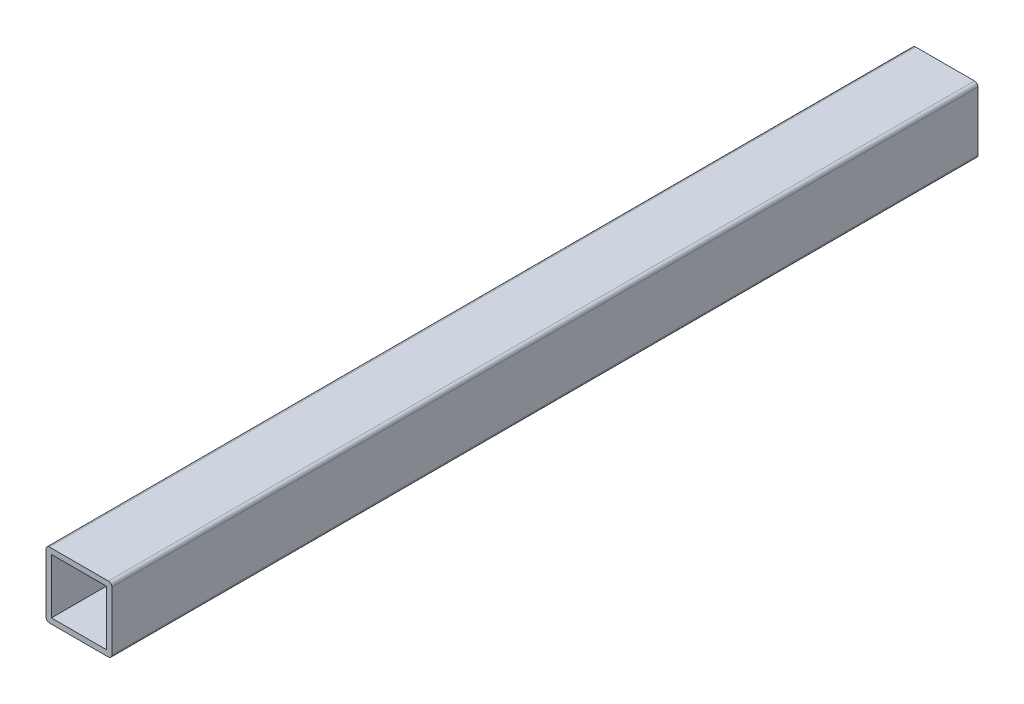
ISO-10303-21;
HEADER;
FILE_DESCRIPTION(('STEP AP214'),'2;1');
FILE_NAME('part.step','',(''),(''),'','','');
FILE_SCHEMA(('AUTOMOTIVE_DESIGN { 1 0 10303 214 1 1 1 1 }'));
ENDSEC;
DATA;
#1=APPLICATION_CONTEXT('core data for automotive mechanical design processes');
#2=APPLICATION_PROTOCOL_DEFINITION('international standard','automotive_design',2000,#1);
#3=PRODUCT_CONTEXT('',#1,'mechanical');
#4=PRODUCT('Part','Part','',(#3));
#5=PRODUCT_RELATED_PRODUCT_CATEGORY('part','',(#4));
#6=PRODUCT_DEFINITION_FORMATION('','',#4);
#7=PRODUCT_DEFINITION_CONTEXT('part definition',#1,'design');
#8=PRODUCT_DEFINITION('design','',#6,#7);
#9=PRODUCT_DEFINITION_SHAPE('','',#8);
#10=(LENGTH_UNIT() NAMED_UNIT(*) SI_UNIT(.MILLI.,.METRE.));
#11=(NAMED_UNIT(*) PLANE_ANGLE_UNIT() SI_UNIT($,.RADIAN.));
#12=(NAMED_UNIT(*) SI_UNIT($,.STERADIAN.) SOLID_ANGLE_UNIT());
#13=UNCERTAINTY_MEASURE_WITH_UNIT(LENGTH_MEASURE(1.E-05),#10,'distance_accuracy_value','');
#14=(GEOMETRIC_REPRESENTATION_CONTEXT(3) GLOBAL_UNCERTAINTY_ASSIGNED_CONTEXT((#13)) GLOBAL_UNIT_ASSIGNED_CONTEXT((#10,
#11,#12)) REPRESENTATION_CONTEXT('',''));
#15=CARTESIAN_POINT('',(0.,0.,0.));
#16=DIRECTION('',(0.,0.,1.));
#17=DIRECTION('',(1.,0.,0.));
#18=AXIS2_PLACEMENT_3D('',#15,#16,#17);
#19=CARTESIAN_POINT('',(0.,0.,0.));
#20=DIRECTION('',(0.,0.,1.));
#21=DIRECTION('',(1.,0.,0.));
#22=AXIS2_PLACEMENT_3D('',#19,#20,#21);
#23=PLANE('',#22);
#24=DIRECTION('',(1.,0.,0.));
#25=VECTOR('',#24,1.);
#26=CARTESIAN_POINT('',(0.,-19.,0.));
#27=LINE('',#26,#25);
#28=CARTESIAN_POINT('',(1.,-19.,0.));
#29=VERTEX_POINT('',#28);
#30=CARTESIAN_POINT('',(18.,-19.,0.));
#31=VERTEX_POINT('',#30);
#32=EDGE_CURVE('E169',#29,#31,#27,.T.);
#33=ORIENTED_EDGE('',*,*,#32,.F.);
#34=CARTESIAN_POINT('',(1.,-18.,0.));
#35=DIRECTION('',(0.,0.,1.));
#36=DIRECTION('',(1.,0.,0.));
#37=AXIS2_PLACEMENT_3D('',#34,#35,#36);
#38=CIRCLE('',#37,1.);
#39=CARTESIAN_POINT('',(0.,-18.,0.));
#40=VERTEX_POINT('',#39);
#41=EDGE_CURVE('E153',#29,#40,#38,.F.);
#42=ORIENTED_EDGE('',*,*,#41,.T.);
#43=DIRECTION('',(0.,-1.,0.));
#44=VECTOR('',#43,1.);
#45=CARTESIAN_POINT('',(0.,0.,0.));
#46=LINE('',#45,#44);
#47=CARTESIAN_POINT('',(0.,-1.,0.));
#48=VERTEX_POINT('',#47);
#49=EDGE_CURVE('E172',#48,#40,#46,.T.);
#50=ORIENTED_EDGE('',*,*,#49,.F.);
#51=CARTESIAN_POINT('',(1.,-1.,0.));
#52=DIRECTION('',(0.,0.,1.));
#53=DIRECTION('',(1.,0.,0.));
#54=AXIS2_PLACEMENT_3D('',#51,#52,#53);
#55=CIRCLE('',#54,1.);
#56=CARTESIAN_POINT('',(1.,0.,0.));
#57=VERTEX_POINT('',#56);
#58=EDGE_CURVE('E155',#48,#57,#55,.F.);
#59=ORIENTED_EDGE('',*,*,#58,.T.);
#60=DIRECTION('',(-1.,0.,0.));
#61=VECTOR('',#60,1.);
#62=CARTESIAN_POINT('',(0.,0.,0.));
#63=LINE('',#62,#61);
#64=CARTESIAN_POINT('',(18.,0.,0.));
#65=VERTEX_POINT('',#64);
#66=EDGE_CURVE('E164',#65,#57,#63,.T.);
#67=ORIENTED_EDGE('',*,*,#66,.F.);
#68=CARTESIAN_POINT('',(18.,-1.,0.));
#69=DIRECTION('',(0.,0.,1.));
#70=DIRECTION('',(1.,0.,0.));
#71=AXIS2_PLACEMENT_3D('',#68,#69,#70);
#72=CIRCLE('',#71,1.);
#73=CARTESIAN_POINT('',(19.,-1.,0.));
#74=VERTEX_POINT('',#73);
#75=EDGE_CURVE('E158',#65,#74,#72,.F.);
#76=ORIENTED_EDGE('',*,*,#75,.T.);
#77=DIRECTION('',(0.,1.,0.));
#78=VECTOR('',#77,1.);
#79=CARTESIAN_POINT('',(19.,0.,0.));
#80=LINE('',#79,#78);
#81=CARTESIAN_POINT('',(19.,-18.,0.));
#82=VERTEX_POINT('',#81);
#83=EDGE_CURVE('E167',#82,#74,#80,.T.);
#84=ORIENTED_EDGE('',*,*,#83,.F.);
#85=CARTESIAN_POINT('',(18.,-18.,0.));
#86=DIRECTION('',(0.,0.,1.));
#87=DIRECTION('',(1.,0.,0.));
#88=AXIS2_PLACEMENT_3D('',#85,#86,#87);
#89=CIRCLE('',#88,1.);
#90=EDGE_CURVE('E139',#82,#31,#89,.F.);
#91=ORIENTED_EDGE('',*,*,#90,.T.);
#92=EDGE_LOOP('',(#33,#42,#50,#59,#67,#76,#84,#91));
#93=FACE_BOUND('',#92,.T.);
#94=DIRECTION('',(0.,-1.,0.));
#95=VECTOR('',#94,1.);
#96=CARTESIAN_POINT('',(1.56,-1.56,0.));
#97=LINE('',#96,#95);
#98=CARTESIAN_POINT('',(1.56,-1.56,0.));
#99=VERTEX_POINT('',#98);
#100=CARTESIAN_POINT('',(1.56,-17.44,0.));
#101=VERTEX_POINT('',#100);
#102=EDGE_CURVE('E192',#99,#101,#97,.T.);
#103=ORIENTED_EDGE('',*,*,#102,.T.);
#104=DIRECTION('',(1.,0.,0.));
#105=VECTOR('',#104,1.);
#106=CARTESIAN_POINT('',(1.56,-17.44,0.));
#107=LINE('',#106,#105);
#108=CARTESIAN_POINT('',(17.44,-17.44,0.));
#109=VERTEX_POINT('',#108);
#110=EDGE_CURVE('E189',#101,#109,#107,.T.);
#111=ORIENTED_EDGE('',*,*,#110,.T.);
#112=DIRECTION('',(0.,1.,0.));
#113=VECTOR('',#112,1.);
#114=CARTESIAN_POINT('',(17.44,-1.56,0.));
#115=LINE('',#114,#113);
#116=CARTESIAN_POINT('',(17.44,-1.56,0.));
#117=VERTEX_POINT('',#116);
#118=EDGE_CURVE('E186',#109,#117,#115,.T.);
#119=ORIENTED_EDGE('',*,*,#118,.T.);
#120=DIRECTION('',(-1.,0.,0.));
#121=VECTOR('',#120,1.);
#122=CARTESIAN_POINT('',(1.56,-1.56,0.));
#123=LINE('',#122,#121);
#124=EDGE_CURVE('E183',#117,#99,#123,.T.);
#125=ORIENTED_EDGE('',*,*,#124,.T.);
#126=EDGE_LOOP('',(#103,#111,#119,#125));
#127=FACE_BOUND('',#126,.T.);
#128=ADVANCED_FACE('F33',(#93,#127),#23,.F.);
#129=CARTESIAN_POINT('',(0.,0.,900.));
#130=DIRECTION('',(1.,0.,0.));
#131=DIRECTION('',(0.,1.,0.));
#132=AXIS2_PLACEMENT_3D('',#129,#130,#131);
#133=PLANE('',#132);
#134=DIRECTION('',(0.,0.,-1.));
#135=VECTOR('',#134,1.);
#136=CARTESIAN_POINT('',(0.,-18.,900.));
#137=LINE('',#136,#135);
#138=CARTESIAN_POINT('',(0.,-18.,250.));
#139=VERTEX_POINT('',#138);
#140=EDGE_CURVE('E148',#40,#139,#137,.F.);
#141=ORIENTED_EDGE('',*,*,#140,.T.);
#142=DIRECTION('',(0.,1.,0.));
#143=VECTOR('',#142,1.);
#144=CARTESIAN_POINT('',(0.,0.,250.));
#145=LINE('',#144,#143);
#146=CARTESIAN_POINT('',(0.,-1.,250.));
#147=VERTEX_POINT('',#146);
#148=EDGE_CURVE('E204',#139,#147,#145,.T.);
#149=ORIENTED_EDGE('',*,*,#148,.T.);
#150=DIRECTION('',(0.,0.,-1.));
#151=VECTOR('',#150,1.);
#152=CARTESIAN_POINT('',(0.,-1.,900.));
#153=LINE('',#152,#151);
#154=EDGE_CURVE('E151',#147,#48,#153,.T.);
#155=ORIENTED_EDGE('',*,*,#154,.T.);
#156=ORIENTED_EDGE('',*,*,#49,.T.);
#157=EDGE_LOOP('',(#141,#149,#155,#156));
#158=FACE_BOUND('',#157,.T.);
#159=ADVANCED_FACE('F228',(#158),#133,.F.);
#160=CARTESIAN_POINT('',(0.,-19.,900.));
#161=DIRECTION('',(0.,1.,0.));
#162=DIRECTION('',(0.,0.,1.));
#163=AXIS2_PLACEMENT_3D('',#160,#161,#162);
#164=PLANE('',#163);
#165=DIRECTION('',(0.,0.,-1.));
#166=VECTOR('',#165,1.);
#167=CARTESIAN_POINT('',(18.,-19.,900.));
#168=LINE('',#167,#166);
#169=CARTESIAN_POINT('',(18.,-19.,250.));
#170=VERTEX_POINT('',#169);
#171=EDGE_CURVE('E162',#31,#170,#168,.F.);
#172=ORIENTED_EDGE('',*,*,#171,.T.);
#173=DIRECTION('',(1.,0.,0.));
#174=VECTOR('',#173,1.);
#175=CARTESIAN_POINT('',(-32.,-19.,250.));
#176=LINE('',#175,#174);
#177=CARTESIAN_POINT('',(1.,-19.,250.));
#178=VERTEX_POINT('',#177);
#179=EDGE_CURVE('E122',#178,#170,#176,.T.);
#180=ORIENTED_EDGE('',*,*,#179,.F.);
#181=DIRECTION('',(0.,0.,-1.));
#182=VECTOR('',#181,1.);
#183=CARTESIAN_POINT('',(1.,-19.,900.));
#184=LINE('',#183,#182);
#185=EDGE_CURVE('E160',#178,#29,#184,.T.);
#186=ORIENTED_EDGE('',*,*,#185,.T.);
#187=ORIENTED_EDGE('',*,*,#32,.T.);
#188=EDGE_LOOP('',(#172,#180,#186,#187));
#189=FACE_BOUND('',#188,.T.);
#190=ADVANCED_FACE('F235',(#189),#164,.F.);
#191=CARTESIAN_POINT('',(19.,0.,900.));
#192=DIRECTION('',(-1.,0.,0.));
#193=DIRECTION('',(0.,0.,1.));
#194=AXIS2_PLACEMENT_3D('',#191,#192,#193);
#195=PLANE('',#194);
#196=DIRECTION('',(0.,0.,-1.));
#197=VECTOR('',#196,1.);
#198=CARTESIAN_POINT('',(19.,-1.,900.));
#199=LINE('',#198,#197);
#200=CARTESIAN_POINT('',(19.,-1.,250.));
#201=VERTEX_POINT('',#200);
#202=EDGE_CURVE('E136',#74,#201,#199,.F.);
#203=ORIENTED_EDGE('',*,*,#202,.T.);
#204=DIRECTION('',(0.,1.,0.));
#205=VECTOR('',#204,1.);
#206=CARTESIAN_POINT('',(19.,-19.,250.));
#207=LINE('',#206,#205);
#208=CARTESIAN_POINT('',(19.,-18.,250.));
#209=VERTEX_POINT('',#208);
#210=EDGE_CURVE('E55',#209,#201,#207,.T.);
#211=ORIENTED_EDGE('',*,*,#210,.F.);
#212=DIRECTION('',(0.,0.,-1.));
#213=VECTOR('',#212,1.);
#214=CARTESIAN_POINT('',(19.,-18.,900.));
#215=LINE('',#214,#213);
#216=EDGE_CURVE('E41',#209,#82,#215,.T.);
#217=ORIENTED_EDGE('',*,*,#216,.T.);
#218=ORIENTED_EDGE('',*,*,#83,.T.);
#219=EDGE_LOOP('',(#203,#211,#217,#218));
#220=FACE_BOUND('',#219,.T.);
#221=ADVANCED_FACE('F132',(#220),#195,.F.);
#222=CARTESIAN_POINT('',(0.,0.,900.));
#223=DIRECTION('',(0.,-1.,0.));
#224=DIRECTION('',(0.,0.,-1.));
#225=AXIS2_PLACEMENT_3D('',#222,#223,#224);
#226=PLANE('',#225);
#227=DIRECTION('',(0.,0.,-1.));
#228=VECTOR('',#227,1.);
#229=CARTESIAN_POINT('',(1.,0.,900.));
#230=LINE('',#229,#228);
#231=CARTESIAN_POINT('',(1.,0.,250.));
#232=VERTEX_POINT('',#231);
#233=EDGE_CURVE('E141',#57,#232,#230,.F.);
#234=ORIENTED_EDGE('',*,*,#233,.T.);
#235=DIRECTION('',(1.,0.,0.));
#236=VECTOR('',#235,1.);
#237=CARTESIAN_POINT('',(-32.,0.,250.));
#238=LINE('',#237,#236);
#239=CARTESIAN_POINT('',(18.,0.,250.));
#240=VERTEX_POINT('',#239);
#241=EDGE_CURVE('E128',#232,#240,#238,.T.);
#242=ORIENTED_EDGE('',*,*,#241,.T.);
#243=DIRECTION('',(0.,0.,-1.));
#244=VECTOR('',#243,1.);
#245=CARTESIAN_POINT('',(18.,0.,900.));
#246=LINE('',#245,#244);
#247=EDGE_CURVE('E146',#240,#65,#246,.T.);
#248=ORIENTED_EDGE('',*,*,#247,.T.);
#249=ORIENTED_EDGE('',*,*,#66,.T.);
#250=EDGE_LOOP('',(#234,#242,#248,#249));
#251=FACE_BOUND('',#250,.T.);
#252=ADVANCED_FACE('F212',(#251),#226,.F.);
#253=CARTESIAN_POINT('',(1.56,-1.56,900.));
#254=DIRECTION('',(1.,0.,0.));
#255=DIRECTION('',(0.,1.,0.));
#256=AXIS2_PLACEMENT_3D('',#253,#254,#255);
#257=PLANE('',#256);
#258=DIRECTION('',(0.,1.,0.));
#259=VECTOR('',#258,1.);
#260=CARTESIAN_POINT('',(1.56,-1.56,250.));
#261=LINE('',#260,#259);
#262=CARTESIAN_POINT('',(1.56,-17.44,250.));
#263=VERTEX_POINT('',#262);
#264=CARTESIAN_POINT('',(1.56,-1.56,250.));
#265=VERTEX_POINT('',#264);
#266=EDGE_CURVE('E48',#263,#265,#261,.T.);
#267=ORIENTED_EDGE('',*,*,#266,.F.);
#268=DIRECTION('',(0.,0.,-1.));
#269=VECTOR('',#268,1.);
#270=CARTESIAN_POINT('',(1.56,-17.44,900.));
#271=LINE('',#270,#269);
#272=EDGE_CURVE('E175',#263,#101,#271,.T.);
#273=ORIENTED_EDGE('',*,*,#272,.T.);
#274=ORIENTED_EDGE('',*,*,#102,.F.);
#275=DIRECTION('',(0.,0.,-1.));
#276=VECTOR('',#275,1.);
#277=CARTESIAN_POINT('',(1.56,-1.56,900.));
#278=LINE('',#277,#276);
#279=EDGE_CURVE('E181',#265,#99,#278,.T.);
#280=ORIENTED_EDGE('',*,*,#279,.F.);
#281=EDGE_LOOP('',(#267,#273,#274,#280));
#282=FACE_BOUND('',#281,.T.);
#283=ADVANCED_FACE('F250',(#282),#257,.T.);
#284=CARTESIAN_POINT('',(1.56,-17.44,900.));
#285=DIRECTION('',(0.,1.,0.));
#286=DIRECTION('',(0.,0.,1.));
#287=AXIS2_PLACEMENT_3D('',#284,#285,#286);
#288=PLANE('',#287);
#289=DIRECTION('',(-1.,0.,0.));
#290=VECTOR('',#289,1.);
#291=CARTESIAN_POINT('',(1.56,-17.44,250.));
#292=LINE('',#291,#290);
#293=CARTESIAN_POINT('',(17.44,-17.44,250.));
#294=VERTEX_POINT('',#293);
#295=EDGE_CURVE('E196',#294,#263,#292,.T.);
#296=ORIENTED_EDGE('',*,*,#295,.F.);
#297=DIRECTION('',(0.,0.,-1.));
#298=VECTOR('',#297,1.);
#299=CARTESIAN_POINT('',(17.44,-17.44,900.));
#300=LINE('',#299,#298);
#301=EDGE_CURVE('E177',#294,#109,#300,.T.);
#302=ORIENTED_EDGE('',*,*,#301,.T.);
#303=ORIENTED_EDGE('',*,*,#110,.F.);
#304=ORIENTED_EDGE('',*,*,#272,.F.);
#305=EDGE_LOOP('',(#296,#302,#303,#304));
#306=FACE_BOUND('',#305,.T.);
#307=ADVANCED_FACE('F256',(#306),#288,.T.);
#308=CARTESIAN_POINT('',(17.44,-1.56,900.));
#309=DIRECTION('',(-1.,0.,0.));
#310=DIRECTION('',(0.,-1.,0.));
#311=AXIS2_PLACEMENT_3D('',#308,#309,#310);
#312=PLANE('',#311);
#313=DIRECTION('',(0.,-1.,0.));
#314=VECTOR('',#313,1.);
#315=CARTESIAN_POINT('',(17.44,-1.56,250.));
#316=LINE('',#315,#314);
#317=CARTESIAN_POINT('',(17.44,-1.56,250.));
#318=VERTEX_POINT('',#317);
#319=EDGE_CURVE('E198',#318,#294,#316,.T.);
#320=ORIENTED_EDGE('',*,*,#319,.F.);
#321=DIRECTION('',(0.,0.,-1.));
#322=VECTOR('',#321,1.);
#323=CARTESIAN_POINT('',(17.44,-1.56,900.));
#324=LINE('',#323,#322);
#325=EDGE_CURVE('E179',#318,#117,#324,.T.);
#326=ORIENTED_EDGE('',*,*,#325,.T.);
#327=ORIENTED_EDGE('',*,*,#118,.F.);
#328=ORIENTED_EDGE('',*,*,#301,.F.);
#329=EDGE_LOOP('',(#320,#326,#327,#328));
#330=FACE_BOUND('',#329,.T.);
#331=ADVANCED_FACE('F261',(#330),#312,.T.);
#332=CARTESIAN_POINT('',(1.56,-1.56,900.));
#333=DIRECTION('',(0.,-1.,0.));
#334=DIRECTION('',(0.,0.,-1.));
#335=AXIS2_PLACEMENT_3D('',#332,#333,#334);
#336=PLANE('',#335);
#337=DIRECTION('',(1.,0.,0.));
#338=VECTOR('',#337,1.);
#339=CARTESIAN_POINT('',(1.56,-1.56,250.));
#340=LINE('',#339,#338);
#341=EDGE_CURVE('E200',#265,#318,#340,.T.);
#342=ORIENTED_EDGE('',*,*,#341,.F.);
#343=ORIENTED_EDGE('',*,*,#279,.T.);
#344=ORIENTED_EDGE('',*,*,#124,.F.);
#345=ORIENTED_EDGE('',*,*,#325,.F.);
#346=EDGE_LOOP('',(#342,#343,#344,#345));
#347=FACE_BOUND('',#346,.T.);
#348=ADVANCED_FACE('F273',(#347),#336,.T.);
#349=CARTESIAN_POINT('',(1.,-18.,900.));
#350=DIRECTION('',(0.,0.,-1.));
#351=DIRECTION('',(-1.,0.,0.));
#352=AXIS2_PLACEMENT_3D('',#349,#350,#351);
#353=CYLINDRICAL_SURFACE('',#352,1.);
#354=CARTESIAN_POINT('',(1.,-18.,250.));
#355=DIRECTION('',(0.,0.,-1.));
#356=DIRECTION('',(-1.,0.,0.));
#357=AXIS2_PLACEMENT_3D('',#354,#355,#356);
#358=CIRCLE('',#357,1.);
#359=EDGE_CURVE('E202',#139,#178,#358,.F.);
#360=ORIENTED_EDGE('',*,*,#359,.F.);
#361=ORIENTED_EDGE('',*,*,#140,.F.);
#362=ORIENTED_EDGE('',*,*,#41,.F.);
#363=ORIENTED_EDGE('',*,*,#185,.F.);
#364=EDGE_LOOP('',(#360,#361,#362,#363));
#365=FACE_BOUND('',#364,.T.);
#366=ADVANCED_FACE('F232',(#365),#353,.T.);
#367=CARTESIAN_POINT('',(1.,-1.,900.));
#368=DIRECTION('',(0.,0.,-1.));
#369=DIRECTION('',(-1.,0.,0.));
#370=AXIS2_PLACEMENT_3D('',#367,#368,#369);
#371=CYLINDRICAL_SURFACE('',#370,1.);
#372=CARTESIAN_POINT('',(1.,-1.,250.));
#373=DIRECTION('',(0.,0.,-1.));
#374=DIRECTION('',(-1.,0.,0.));
#375=AXIS2_PLACEMENT_3D('',#372,#373,#374);
#376=CIRCLE('',#375,1.);
#377=EDGE_CURVE('E127',#232,#147,#376,.F.);
#378=ORIENTED_EDGE('',*,*,#377,.F.);
#379=ORIENTED_EDGE('',*,*,#233,.F.);
#380=ORIENTED_EDGE('',*,*,#58,.F.);
#381=ORIENTED_EDGE('',*,*,#154,.F.);
#382=EDGE_LOOP('',(#378,#379,#380,#381));
#383=FACE_BOUND('',#382,.T.);
#384=ADVANCED_FACE('F224',(#383),#371,.T.);
#385=CARTESIAN_POINT('',(18.,-18.,900.));
#386=DIRECTION('',(0.,0.,-1.));
#387=DIRECTION('',(-1.,0.,0.));
#388=AXIS2_PLACEMENT_3D('',#385,#386,#387);
#389=CYLINDRICAL_SURFACE('',#388,1.);
#390=CARTESIAN_POINT('',(18.,-18.,250.));
#391=DIRECTION('',(0.,0.,-1.));
#392=DIRECTION('',(-1.,0.,0.));
#393=AXIS2_PLACEMENT_3D('',#390,#391,#392);
#394=CIRCLE('',#393,1.);
#395=EDGE_CURVE('E119',#170,#209,#394,.F.);
#396=ORIENTED_EDGE('',*,*,#395,.F.);
#397=ORIENTED_EDGE('',*,*,#171,.F.);
#398=ORIENTED_EDGE('',*,*,#90,.F.);
#399=ORIENTED_EDGE('',*,*,#216,.F.);
#400=EDGE_LOOP('',(#396,#397,#398,#399));
#401=FACE_BOUND('',#400,.T.);
#402=ADVANCED_FACE('F138',(#401),#389,.T.);
#403=CARTESIAN_POINT('',(18.,-1.,900.));
#404=DIRECTION('',(0.,0.,-1.));
#405=DIRECTION('',(-1.,0.,0.));
#406=AXIS2_PLACEMENT_3D('',#403,#404,#405);
#407=CYLINDRICAL_SURFACE('',#406,1.);
#408=CARTESIAN_POINT('',(18.,-1.,250.));
#409=DIRECTION('',(0.,0.,-1.));
#410=DIRECTION('',(-1.,0.,0.));
#411=AXIS2_PLACEMENT_3D('',#408,#409,#410);
#412=CIRCLE('',#411,1.);
#413=EDGE_CURVE('E11',#201,#240,#412,.F.);
#414=ORIENTED_EDGE('',*,*,#413,.F.);
#415=ORIENTED_EDGE('',*,*,#202,.F.);
#416=ORIENTED_EDGE('',*,*,#75,.F.);
#417=ORIENTED_EDGE('',*,*,#247,.F.);
#418=EDGE_LOOP('',(#414,#415,#416,#417));
#419=FACE_BOUND('',#418,.T.);
#420=ADVANCED_FACE('F35',(#419),#407,.T.);
#421=CARTESIAN_POINT('',(-32.,-19.,250.));
#422=DIRECTION('',(0.,0.,-1.));
#423=DIRECTION('',(-1.,0.,0.));
#424=AXIS2_PLACEMENT_3D('',#421,#422,#423);
#425=PLANE('',#424);
#426=ORIENTED_EDGE('',*,*,#266,.T.);
#427=ORIENTED_EDGE('',*,*,#341,.T.);
#428=ORIENTED_EDGE('',*,*,#319,.T.);
#429=ORIENTED_EDGE('',*,*,#295,.T.);
#430=EDGE_LOOP('',(#426,#427,#428,#429));
#431=FACE_BOUND('',#430,.T.);
#432=ORIENTED_EDGE('',*,*,#359,.T.);
#433=ORIENTED_EDGE('',*,*,#179,.T.);
#434=ORIENTED_EDGE('',*,*,#395,.T.);
#435=ORIENTED_EDGE('',*,*,#210,.T.);
#436=ORIENTED_EDGE('',*,*,#413,.T.);
#437=ORIENTED_EDGE('',*,*,#241,.F.);
#438=ORIENTED_EDGE('',*,*,#377,.T.);
#439=ORIENTED_EDGE('',*,*,#148,.F.);
#440=EDGE_LOOP('',(#432,#433,#434,#435,#436,#437,#438,#439));
#441=FACE_BOUND('',#440,.T.);
#442=ADVANCED_FACE('F120',(#431,#441),#425,.F.);
#443=CLOSED_SHELL('',(#128,#159,#190,#221,#252,#283,#307,#331,#348,#366,#384,#402,#420,#442));
#444=MANIFOLD_SOLID_BREP('B2',#443);
#445=ADVANCED_BREP_SHAPE_REPRESENTATION('',(#18,#444),#14);
#446=SHAPE_DEFINITION_REPRESENTATION(#9,#445);
ENDSEC;
END-ISO-10303-21;
